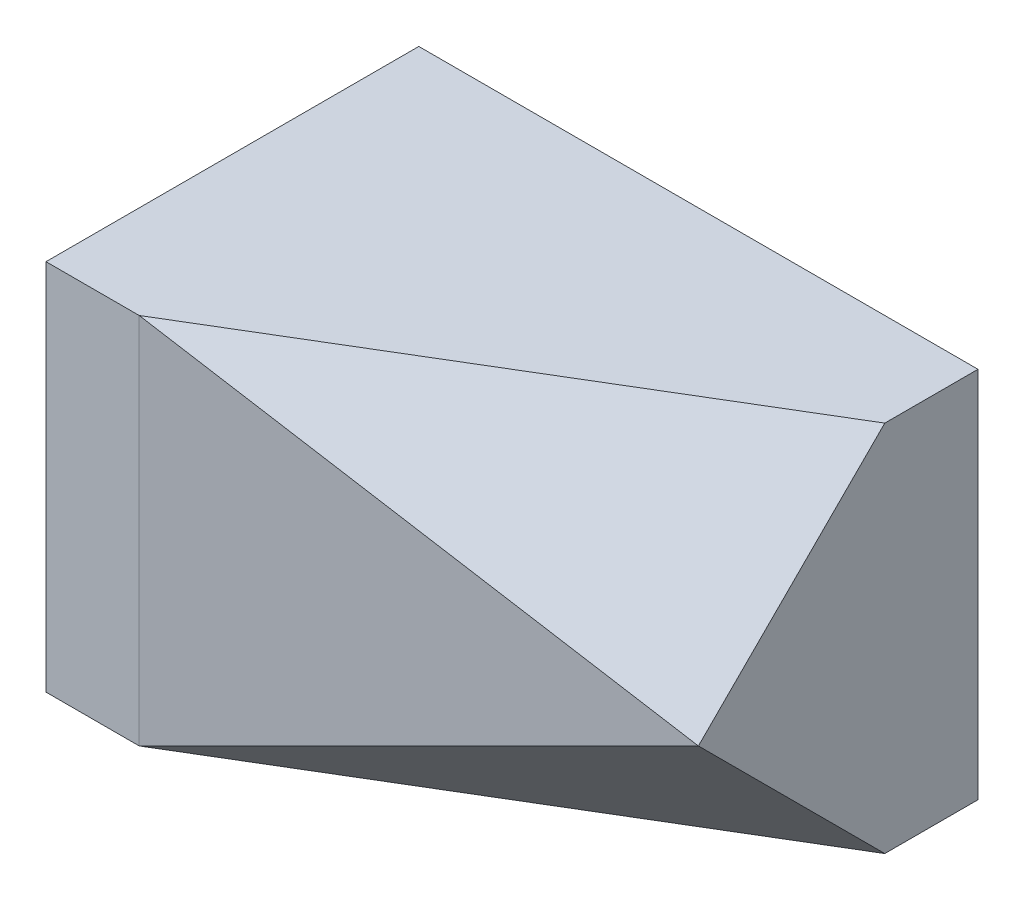
ISO-10303-21;
HEADER;
FILE_DESCRIPTION(('STEP AP214'),'2;1');
FILE_NAME('part.step','',(''),(''),'','','');
FILE_SCHEMA(('AUTOMOTIVE_DESIGN { 1 0 10303 214 1 1 1 1 }'));
ENDSEC;
DATA;
#1=APPLICATION_CONTEXT('core data for automotive mechanical design processes');
#2=APPLICATION_PROTOCOL_DEFINITION('international standard','automotive_design',2000,#1);
#3=PRODUCT_CONTEXT('',#1,'mechanical');
#4=PRODUCT('Part','Part','',(#3));
#5=PRODUCT_RELATED_PRODUCT_CATEGORY('part','',(#4));
#6=PRODUCT_DEFINITION_FORMATION('','',#4);
#7=PRODUCT_DEFINITION_CONTEXT('part definition',#1,'design');
#8=PRODUCT_DEFINITION('design','',#6,#7);
#9=PRODUCT_DEFINITION_SHAPE('','',#8);
#10=(LENGTH_UNIT() NAMED_UNIT(*) SI_UNIT(.MILLI.,.METRE.));
#11=(NAMED_UNIT(*) PLANE_ANGLE_UNIT() SI_UNIT($,.RADIAN.));
#12=(NAMED_UNIT(*) SI_UNIT($,.STERADIAN.) SOLID_ANGLE_UNIT());
#13=UNCERTAINTY_MEASURE_WITH_UNIT(LENGTH_MEASURE(1.E-05),#10,'distance_accuracy_value','');
#14=(GEOMETRIC_REPRESENTATION_CONTEXT(3) GLOBAL_UNCERTAINTY_ASSIGNED_CONTEXT((#13)) GLOBAL_UNIT_ASSIGNED_CONTEXT((#10,
#11,#12)) REPRESENTATION_CONTEXT('',''));
#15=CARTESIAN_POINT('',(0.,0.,0.));
#16=DIRECTION('',(0.,0.,1.));
#17=DIRECTION('',(1.,0.,0.));
#18=AXIS2_PLACEMENT_3D('',#15,#16,#17);
#19=CARTESIAN_POINT('',(30.,40.,20.));
#20=DIRECTION('',(-1.,0.,0.));
#21=DIRECTION('',(0.,0.,1.));
#22=AXIS2_PLACEMENT_3D('',#19,#20,#21);
#23=PLANE('',#22);
#24=DIRECTION('',(0.,-0.707106781186548,0.707106781186548));
#25=VECTOR('',#24,1.);
#26=CARTESIAN_POINT('',(30.,3.02842458632807,26.9715754136719));
#27=LINE('',#26,#25);
#28=CARTESIAN_POINT('',(30.,40.,-10.));
#29=VERTEX_POINT('',#28);
#30=CARTESIAN_POINT('',(30.,20.,9.99999999999999));
#31=VERTEX_POINT('',#30);
#32=EDGE_CURVE('E216',#29,#31,#27,.T.);
#33=ORIENTED_EDGE('',*,*,#32,.T.);
#34=DIRECTION('',(0.,0.707106781186548,0.707106781186547));
#35=VECTOR('',#34,1.);
#36=CARTESIAN_POINT('',(30.,36.9715754136721,26.971575413672));
#37=LINE('',#36,#35);
#38=CARTESIAN_POINT('',(30.,0.,-10.));
#39=VERTEX_POINT('',#38);
#40=EDGE_CURVE('E204',#39,#31,#37,.T.);
#41=ORIENTED_EDGE('',*,*,#40,.F.);
#42=DIRECTION('',(0.,0.,-1.));
#43=VECTOR('',#42,1.);
#44=CARTESIAN_POINT('',(30.,0.,20.));
#45=LINE('',#44,#43);
#46=CARTESIAN_POINT('',(30.,0.,-20.));
#47=VERTEX_POINT('',#46);
#48=EDGE_CURVE('E215',#39,#47,#45,.T.);
#49=ORIENTED_EDGE('',*,*,#48,.T.);
#50=DIRECTION('',(0.,-1.,0.));
#51=VECTOR('',#50,1.);
#52=CARTESIAN_POINT('',(30.,40.,-20.));
#53=LINE('',#52,#51);
#54=CARTESIAN_POINT('',(30.,40.,-20.));
#55=VERTEX_POINT('',#54);
#56=EDGE_CURVE('E150',#55,#47,#53,.T.);
#57=ORIENTED_EDGE('',*,*,#56,.F.);
#58=DIRECTION('',(0.,0.,-1.));
#59=VECTOR('',#58,1.);
#60=CARTESIAN_POINT('',(30.,40.,20.));
#61=LINE('',#60,#59);
#62=EDGE_CURVE('E183',#29,#55,#61,.T.);
#63=ORIENTED_EDGE('',*,*,#62,.F.);
#64=EDGE_LOOP('',(#33,#41,#49,#57,#63));
#65=FACE_BOUND('',#64,.T.);
#66=ADVANCED_FACE('F142',(#65),#23,.F.);
#67=CARTESIAN_POINT('',(-30.,40.,-20.));
#68=DIRECTION('',(0.,0.,1.));
#69=DIRECTION('',(1.,0.,0.));
#70=AXIS2_PLACEMENT_3D('',#67,#68,#69);
#71=PLANE('',#70);
#72=DIRECTION('',(-1.,0.,0.));
#73=VECTOR('',#72,1.);
#74=CARTESIAN_POINT('',(-30.,0.,-20.));
#75=LINE('',#74,#73);
#76=CARTESIAN_POINT('',(-30.,0.,-20.));
#77=VERTEX_POINT('',#76);
#78=EDGE_CURVE('E173',#47,#77,#75,.T.);
#79=ORIENTED_EDGE('',*,*,#78,.T.);
#80=DIRECTION('',(0.,-1.,0.));
#81=VECTOR('',#80,1.);
#82=CARTESIAN_POINT('',(-30.,40.,-20.));
#83=LINE('',#82,#81);
#84=CARTESIAN_POINT('',(-30.,40.,-20.));
#85=VERTEX_POINT('',#84);
#86=EDGE_CURVE('E235',#85,#77,#83,.T.);
#87=ORIENTED_EDGE('',*,*,#86,.F.);
#88=DIRECTION('',(-1.,0.,0.));
#89=VECTOR('',#88,1.);
#90=CARTESIAN_POINT('',(-30.,40.,-20.));
#91=LINE('',#90,#89);
#92=EDGE_CURVE('E237',#55,#85,#91,.T.);
#93=ORIENTED_EDGE('',*,*,#92,.F.);
#94=ORIENTED_EDGE('',*,*,#56,.T.);
#95=EDGE_LOOP('',(#79,#87,#93,#94));
#96=FACE_BOUND('',#95,.T.);
#97=ADVANCED_FACE('F236',(#96),#71,.F.);
#98=CARTESIAN_POINT('',(-30.,40.,20.));
#99=DIRECTION('',(1.,0.,0.));
#100=DIRECTION('',(0.,0.,-1.));
#101=AXIS2_PLACEMENT_3D('',#98,#99,#100);
#102=PLANE('',#101);
#103=DIRECTION('',(0.,0.,1.));
#104=VECTOR('',#103,1.);
#105=CARTESIAN_POINT('',(-30.,0.,20.));
#106=LINE('',#105,#104);
#107=CARTESIAN_POINT('',(-30.,0.,20.));
#108=VERTEX_POINT('',#107);
#109=EDGE_CURVE('E178',#77,#108,#106,.T.);
#110=ORIENTED_EDGE('',*,*,#109,.T.);
#111=DIRECTION('',(0.,-1.,0.));
#112=VECTOR('',#111,1.);
#113=CARTESIAN_POINT('',(-30.,40.,20.));
#114=LINE('',#113,#112);
#115=CARTESIAN_POINT('',(-30.,40.,20.));
#116=VERTEX_POINT('',#115);
#117=EDGE_CURVE('E233',#116,#108,#114,.T.);
#118=ORIENTED_EDGE('',*,*,#117,.F.);
#119=DIRECTION('',(0.,0.,1.));
#120=VECTOR('',#119,1.);
#121=CARTESIAN_POINT('',(-30.,40.,20.));
#122=LINE('',#121,#120);
#123=EDGE_CURVE('E158',#85,#116,#122,.T.);
#124=ORIENTED_EDGE('',*,*,#123,.F.);
#125=ORIENTED_EDGE('',*,*,#86,.T.);
#126=EDGE_LOOP('',(#110,#118,#124,#125));
#127=FACE_BOUND('',#126,.T.);
#128=ADVANCED_FACE('F264',(#127),#102,.F.);
#129=CARTESIAN_POINT('',(-30.,40.,20.));
#130=DIRECTION('',(0.,0.,-1.));
#131=DIRECTION('',(-1.,0.,0.));
#132=AXIS2_PLACEMENT_3D('',#129,#130,#131);
#133=PLANE('',#132);
#134=DIRECTION('',(1.,0.,0.));
#135=VECTOR('',#134,1.);
#136=CARTESIAN_POINT('',(-30.,0.,20.));
#137=LINE('',#136,#135);
#138=CARTESIAN_POINT('',(-20.0000000000002,0.,20.));
#139=VERTEX_POINT('',#138);
#140=EDGE_CURVE('E230',#108,#139,#137,.T.);
#141=ORIENTED_EDGE('',*,*,#140,.T.);
#142=DIRECTION('',(0.,1.,0.));
#143=VECTOR('',#142,1.);
#144=CARTESIAN_POINT('',(-20.,0.,20.));
#145=LINE('',#144,#143);
#146=CARTESIAN_POINT('',(-20.,40.,20.));
#147=VERTEX_POINT('',#146);
#148=EDGE_CURVE('E219',#139,#147,#145,.T.);
#149=ORIENTED_EDGE('',*,*,#148,.T.);
#150=DIRECTION('',(1.,0.,0.));
#151=VECTOR('',#150,1.);
#152=CARTESIAN_POINT('',(-30.,40.,20.));
#153=LINE('',#152,#151);
#154=EDGE_CURVE('E226',#116,#147,#153,.T.);
#155=ORIENTED_EDGE('',*,*,#154,.F.);
#156=ORIENTED_EDGE('',*,*,#117,.T.);
#157=EDGE_LOOP('',(#141,#149,#155,#156));
#158=FACE_BOUND('',#157,.T.);
#159=ADVANCED_FACE('F244',(#158),#133,.F.);
#160=CARTESIAN_POINT('',(0.,40.,0.));
#161=DIRECTION('',(0.,-1.,0.));
#162=DIRECTION('',(0.,0.,-1.));
#163=AXIS2_PLACEMENT_3D('',#160,#161,#162);
#164=PLANE('',#163);
#165=ORIENTED_EDGE('',*,*,#154,.T.);
#166=DIRECTION('',(-0.857492925712544,0.,0.514495755427527));
#167=VECTOR('',#166,1.);
#168=CARTESIAN_POINT('',(3.52941176470588,40.,5.88235294117647));
#169=LINE('',#168,#167);
#170=EDGE_CURVE('E223',#29,#147,#169,.T.);
#171=ORIENTED_EDGE('',*,*,#170,.F.);
#172=ORIENTED_EDGE('',*,*,#62,.T.);
#173=ORIENTED_EDGE('',*,*,#92,.T.);
#174=ORIENTED_EDGE('',*,*,#123,.T.);
#175=EDGE_LOOP('',(#165,#171,#172,#173,#174));
#176=FACE_BOUND('',#175,.T.);
#177=ADVANCED_FACE('F242',(#176),#164,.F.);
#178=CARTESIAN_POINT('',(0.,0.,0.));
#179=DIRECTION('',(0.,-1.,0.));
#180=DIRECTION('',(0.,0.,-1.));
#181=AXIS2_PLACEMENT_3D('',#178,#179,#180);
#182=PLANE('',#181);
#183=DIRECTION('',(0.857492925712545,0.,-0.514495755427526));
#184=VECTOR('',#183,1.);
#185=CARTESIAN_POINT('',(-20.0000000000002,0.,20.));
#186=LINE('',#185,#184);
#187=EDGE_CURVE('E201',#139,#39,#186,.T.);
#188=ORIENTED_EDGE('',*,*,#187,.F.);
#189=ORIENTED_EDGE('',*,*,#140,.F.);
#190=ORIENTED_EDGE('',*,*,#109,.F.);
#191=ORIENTED_EDGE('',*,*,#78,.F.);
#192=ORIENTED_EDGE('',*,*,#48,.F.);
#193=EDGE_LOOP('',(#188,#189,#190,#191,#192));
#194=FACE_BOUND('',#193,.T.);
#195=ADVANCED_FACE('F218',(#194),#182,.T.);
#196=CARTESIAN_POINT('',(-20.,0.,20.));
#197=DIRECTION('',(-0.196116135138184,0.,-0.98058067569092));
#198=DIRECTION('',(-0.98058067569092,0.,0.196116135138184));
#199=AXIS2_PLACEMENT_3D('',#196,#197,#198);
#200=PLANE('',#199);
#201=ORIENTED_EDGE('',*,*,#148,.F.);
#202=DIRECTION('',(0.912870929175277,0.36514837167011,-0.182574185835055));
#203=VECTOR('',#202,1.);
#204=CARTESIAN_POINT('',(-20.,0.,20.));
#205=LINE('',#204,#203);
#206=EDGE_CURVE('E206',#139,#31,#205,.T.);
#207=ORIENTED_EDGE('',*,*,#206,.T.);
#208=DIRECTION('',(-0.912870929175277,0.365148371670111,0.182574185835055));
#209=VECTOR('',#208,1.);
#210=CARTESIAN_POINT('',(-6.66666666666668,34.6666666666667,17.3333333333333));
#211=LINE('',#210,#209);
#212=EDGE_CURVE('E97',#31,#147,#211,.T.);
#213=ORIENTED_EDGE('',*,*,#212,.T.);
#214=EDGE_LOOP('',(#201,#207,#213));
#215=FACE_BOUND('',#214,.T.);
#216=ADVANCED_FACE('F246',(#215),#200,.F.);
#217=CARTESIAN_POINT('',(-20.,40.,20.));
#218=DIRECTION('',(-0.390566732942472,-0.650944554904119,-0.650944554904119));
#219=DIRECTION('',(0.,0.707106781186548,-0.707106781186548));
#220=AXIS2_PLACEMENT_3D('',#217,#218,#219);
#221=PLANE('',#220);
#222=ORIENTED_EDGE('',*,*,#32,.F.);
#223=ORIENTED_EDGE('',*,*,#170,.T.);
#224=ORIENTED_EDGE('',*,*,#212,.F.);
#225=EDGE_LOOP('',(#222,#223,#224));
#226=FACE_BOUND('',#225,.T.);
#227=ADVANCED_FACE('F249',(#226),#221,.F.);
#228=CARTESIAN_POINT('',(-20.0000000000002,0.,20.));
#229=DIRECTION('',(-0.390566732942471,0.650944554904119,-0.65094455490412));
#230=DIRECTION('',(0.,0.707106781186548,0.707106781186547));
#231=AXIS2_PLACEMENT_3D('',#228,#229,#230);
#232=PLANE('',#231);
#233=ORIENTED_EDGE('',*,*,#187,.T.);
#234=ORIENTED_EDGE('',*,*,#40,.T.);
#235=ORIENTED_EDGE('',*,*,#206,.F.);
#236=EDGE_LOOP('',(#233,#234,#235));
#237=FACE_BOUND('',#236,.T.);
#238=ADVANCED_FACE('F203',(#237),#232,.F.);
#239=CLOSED_SHELL('',(#66,#97,#128,#159,#177,#195,#216,#227,#238));
#240=MANIFOLD_SOLID_BREP('B39',#239);
#241=ADVANCED_BREP_SHAPE_REPRESENTATION('',(#18,#240),#14);
#242=SHAPE_DEFINITION_REPRESENTATION(#9,#241);
ENDSEC;
END-ISO-10303-21;
